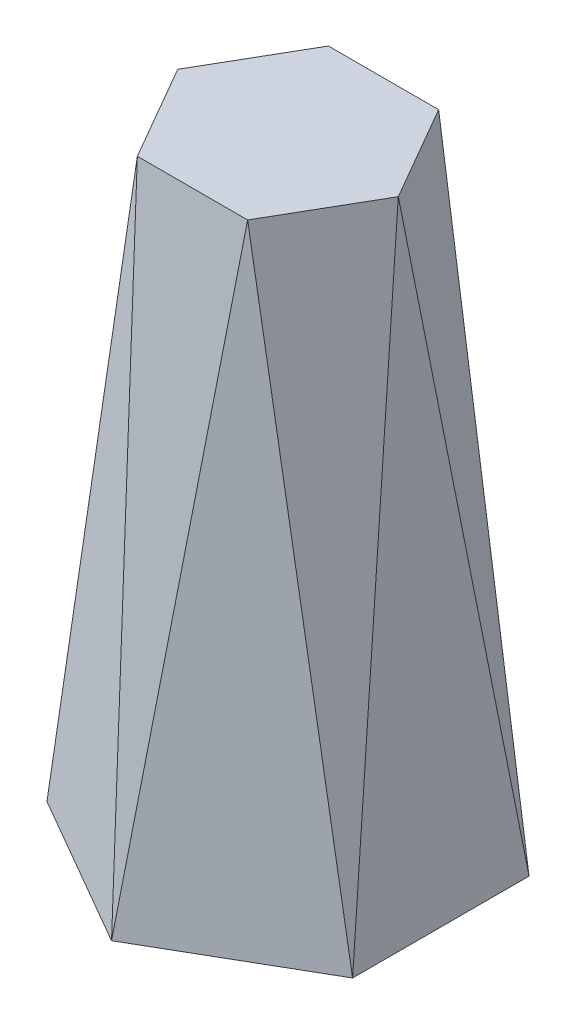
ISO-10303-21;
HEADER;
FILE_DESCRIPTION(('STEP AP214'),'2;1');
FILE_NAME('part.step','',(''),(''),'','','');
FILE_SCHEMA(('AUTOMOTIVE_DESIGN { 1 0 10303 214 1 1 1 1 }'));
ENDSEC;
DATA;
#1=APPLICATION_CONTEXT('core data for automotive mechanical design processes');
#2=APPLICATION_PROTOCOL_DEFINITION('international standard','automotive_design',2000,#1);
#3=PRODUCT_CONTEXT('',#1,'mechanical');
#4=PRODUCT('Part','Part','',(#3));
#5=PRODUCT_RELATED_PRODUCT_CATEGORY('part','',(#4));
#6=PRODUCT_DEFINITION_FORMATION('','',#4);
#7=PRODUCT_DEFINITION_CONTEXT('part definition',#1,'design');
#8=PRODUCT_DEFINITION('design','',#6,#7);
#9=PRODUCT_DEFINITION_SHAPE('','',#8);
#10=(LENGTH_UNIT() NAMED_UNIT(*) SI_UNIT(.MILLI.,.METRE.));
#11=(NAMED_UNIT(*) PLANE_ANGLE_UNIT() SI_UNIT($,.RADIAN.));
#12=(NAMED_UNIT(*) SI_UNIT($,.STERADIAN.) SOLID_ANGLE_UNIT());
#13=UNCERTAINTY_MEASURE_WITH_UNIT(LENGTH_MEASURE(1.E-05),#10,'distance_accuracy_value','');
#14=(GEOMETRIC_REPRESENTATION_CONTEXT(3) GLOBAL_UNCERTAINTY_ASSIGNED_CONTEXT((#13)) GLOBAL_UNIT_ASSIGNED_CONTEXT((#10,
#11,#12)) REPRESENTATION_CONTEXT('',''));
#15=CARTESIAN_POINT('',(0.,0.,0.));
#16=DIRECTION('',(0.,0.,1.));
#17=DIRECTION('',(1.,0.,0.));
#18=AXIS2_PLACEMENT_3D('',#15,#16,#17);
#19=CARTESIAN_POINT('',(0.,80.,0.));
#20=DIRECTION('',(0.,1.,0.));
#21=DIRECTION('',(0.,0.,1.));
#22=AXIS2_PLACEMENT_3D('',#19,#20,#21);
#23=PLANE('',#22);
#24=DIRECTION('',(-1.,0.,0.));
#25=VECTOR('',#24,1.);
#26=CARTESIAN_POINT('',(-1.11291591240031E-13,80.,-12.5));
#27=LINE('',#26,#25);
#28=CARTESIAN_POINT('',(7.21687836487021,80.,-12.5000000000001));
#29=VERTEX_POINT('',#28);
#30=CARTESIAN_POINT('',(-7.21687836487048,80.,-12.4999999999999));
#31=VERTEX_POINT('',#30);
#32=EDGE_CURVE('E117',#29,#31,#27,.T.);
#33=ORIENTED_EDGE('',*,*,#32,.T.);
#34=DIRECTION('',(-0.49999999999999,0.,0.866025403784444));
#35=VECTOR('',#34,1.);
#36=CARTESIAN_POINT('',(-10.8253175473056,80.,-6.24999999999988));
#37=LINE('',#36,#35);
#38=CARTESIAN_POINT('',(-14.4337567297406,80.,0.));
#39=VERTEX_POINT('',#38);
#40=EDGE_CURVE('E103',#31,#39,#37,.T.);
#41=ORIENTED_EDGE('',*,*,#40,.T.);
#42=DIRECTION('',(0.5,0.,0.866025403784439));
#43=VECTOR('',#42,1.);
#44=CARTESIAN_POINT('',(-10.8253175473055,80.,6.25));
#45=LINE('',#44,#43);
#46=CARTESIAN_POINT('',(-7.21687836487034,80.,12.5));
#47=VERTEX_POINT('',#46);
#48=EDGE_CURVE('E115',#39,#47,#45,.T.);
#49=ORIENTED_EDGE('',*,*,#48,.T.);
#50=DIRECTION('',(1.,0.,0.));
#51=VECTOR('',#50,1.);
#52=CARTESIAN_POINT('',(0.,80.,12.5));
#53=LINE('',#52,#51);
#54=CARTESIAN_POINT('',(7.2168783648704,80.,12.5));
#55=VERTEX_POINT('',#54);
#56=EDGE_CURVE('E62',#47,#55,#53,.T.);
#57=ORIENTED_EDGE('',*,*,#56,.T.);
#58=DIRECTION('',(0.499999999999996,0.,-0.866025403784441));
#59=VECTOR('',#58,1.);
#60=CARTESIAN_POINT('',(10.8253175473055,80.,6.24999999999996));
#61=LINE('',#60,#59);
#62=CARTESIAN_POINT('',(14.4337567297406,80.,0.));
#63=VERTEX_POINT('',#62);
#64=EDGE_CURVE('E150',#55,#63,#61,.T.);
#65=ORIENTED_EDGE('',*,*,#64,.T.);
#66=DIRECTION('',(-0.5,0.,-0.866025403784439));
#67=VECTOR('',#66,1.);
#68=CARTESIAN_POINT('',(10.8253175473055,80.,-6.25));
#69=LINE('',#68,#67);
#70=EDGE_CURVE('E159',#63,#29,#69,.T.);
#71=ORIENTED_EDGE('',*,*,#70,.T.);
#72=EDGE_LOOP('',(#33,#41,#49,#57,#65,#71));
#73=FACE_BOUND('',#72,.T.);
#74=ADVANCED_FACE('F47',(#73),#23,.T.);
#75=CARTESIAN_POINT('',(-9.95182219602424,1.38485658313591,-17.2370616714052));
#76=DIRECTION('',(-0.498794100707507,0.0694102326577044,-0.863936724941007));
#77=DIRECTION('',(-0.0347051163288529,-0.997588201414994,-0.0601110247641599));
#78=AXIS2_PLACEMENT_3D('',#75,#76,#77);
#79=PLANE('',#78);
#80=DIRECTION('',(-0.866025403784439,0.,0.5));
#81=VECTOR('',#80,1.);
#82=CARTESIAN_POINT('',(0.,0.,-23.094010767585));
#83=LINE('',#82,#81);
#84=CARTESIAN_POINT('',(-2.37436315882294E-13,0.,-23.0940107675851));
#85=VERTEX_POINT('',#84);
#86=CARTESIAN_POINT('',(-20.,0.,-11.5470053837924));
#87=VERTEX_POINT('',#86);
#88=EDGE_CURVE('E134',#85,#87,#83,.T.);
#89=ORIENTED_EDGE('',*,*,#88,.T.);
#90=DIRECTION('',(0.1577764457849,0.987404800100219,-0.0117623932314135));
#91=VECTOR('',#90,1.);
#92=CARTESIAN_POINT('',(-19.5235611259221,2.98167466556065,-11.5825243825868));
#93=LINE('',#92,#91);
#94=EDGE_CURVE('E105',#87,#31,#93,.T.);
#95=ORIENTED_EDGE('',*,*,#94,.T.);
#96=DIRECTION('',(0.0890747542401528,-0.987404800100219,-0.130757213552837));
#97=VECTOR('',#96,1.);
#98=CARTESIAN_POINT('',(-0.26897979231234,2.98167466556065,-22.6991620986802));
#99=LINE('',#98,#97);
#100=EDGE_CURVE('E12',#31,#85,#99,.T.);
#101=ORIENTED_EDGE('',*,*,#100,.T.);
#102=EDGE_LOOP('',(#89,#95,#101));
#103=FACE_BOUND('',#102,.T.);
#104=ADVANCED_FACE('F172',(#103),#79,.T.);
#105=CARTESIAN_POINT('',(-19.9036443920481,1.38485658313591,0.));
#106=DIRECTION('',(-0.997588201414994,0.0694102326577044,0.));
#107=DIRECTION('',(-0.0694102326577044,-0.997588201414994,0.));
#108=AXIS2_PLACEMENT_3D('',#105,#106,#107);
#109=PLANE('',#108);
#110=DIRECTION('',(0.0687016915447455,0.987404800100219,-0.142519606784248));
#111=VECTOR('',#110,1.);
#112=CARTESIAN_POINT('',(-19.792540918234,2.98167466556065,11.1166377160932));
#113=LINE('',#112,#111);
#114=CARTESIAN_POINT('',(-20.,0.,11.5470053837926));
#115=VERTEX_POINT('',#114);
#116=EDGE_CURVE('E122',#115,#39,#113,.T.);
#117=ORIENTED_EDGE('',*,*,#116,.T.);
#118=DIRECTION('',(-0.0687016915447454,-0.987404800100219,-0.14251960678425));
#119=VECTOR('',#118,1.);
#120=CARTESIAN_POINT('',(-19.792540918234,2.98167466556067,-11.1166377160932));
#121=LINE('',#120,#119);
#122=EDGE_CURVE('E100',#39,#87,#121,.T.);
#123=ORIENTED_EDGE('',*,*,#122,.T.);
#124=DIRECTION('',(0.,0.,1.));
#125=VECTOR('',#124,1.);
#126=CARTESIAN_POINT('',(-20.,0.,-11.5470053837925));
#127=LINE('',#126,#125);
#128=EDGE_CURVE('E128',#87,#115,#127,.T.);
#129=ORIENTED_EDGE('',*,*,#128,.T.);
#130=EDGE_LOOP('',(#117,#123,#129));
#131=FACE_BOUND('',#130,.T.);
#132=ADVANCED_FACE('F126',(#131),#109,.T.);
#133=CARTESIAN_POINT('',(9.95182219602388,1.38485658313591,-17.2370616714054));
#134=DIRECTION('',(0.498794100707489,0.0694102326577044,-0.863936724941017));
#135=DIRECTION('',(0.0347051163288517,-0.997588201414994,-0.0601110247641606));
#136=AXIS2_PLACEMENT_3D('',#133,#134,#135);
#137=PLANE('',#136);
#138=DIRECTION('',(-0.866025403784439,0.,-0.5));
#139=VECTOR('',#138,1.);
#140=CARTESIAN_POINT('',(20.,0.,-11.5470053837925));
#141=LINE('',#140,#139);
#142=CARTESIAN_POINT('',(20.,0.,-11.5470053837926));
#143=VERTEX_POINT('',#142);
#144=EDGE_CURVE('E136',#143,#85,#141,.T.);
#145=ORIENTED_EDGE('',*,*,#144,.T.);
#146=DIRECTION('',(0.0890747542401559,0.987404800100219,0.130757213552835));
#147=VECTOR('',#146,1.);
#148=CARTESIAN_POINT('',(0.268979792311878,2.98167466556065,-22.6991620986802));
#149=LINE('',#148,#147);
#150=EDGE_CURVE('E118',#85,#29,#149,.T.);
#151=ORIENTED_EDGE('',*,*,#150,.T.);
#152=DIRECTION('',(0.157776445784899,-0.987404800100219,0.0117623932314093));
#153=VECTOR('',#152,1.);
#154=CARTESIAN_POINT('',(19.5235611259218,2.98167466556063,-11.5825243825872));
#155=LINE('',#154,#153);
#156=EDGE_CURVE('E164',#29,#143,#155,.T.);
#157=ORIENTED_EDGE('',*,*,#156,.T.);
#158=EDGE_LOOP('',(#145,#151,#157));
#159=FACE_BOUND('',#158,.T.);
#160=ADVANCED_FACE('F178',(#159),#137,.T.);
#161=CARTESIAN_POINT('',(19.9036443920481,1.38485658313591,0.));
#162=DIRECTION('',(0.997588201414994,0.0694102326577044,0.));
#163=DIRECTION('',(0.0694102326577044,-0.997588201414994,0.));
#164=AXIS2_PLACEMENT_3D('',#161,#162,#163);
#165=PLANE('',#164);
#166=DIRECTION('',(0.,0.,-1.));
#167=VECTOR('',#166,1.);
#168=CARTESIAN_POINT('',(20.,0.,11.5470053837925));
#169=LINE('',#168,#167);
#170=CARTESIAN_POINT('',(20.,0.,11.5470053837925));
#171=VERTEX_POINT('',#170);
#172=EDGE_CURVE('E139',#171,#143,#169,.T.);
#173=ORIENTED_EDGE('',*,*,#172,.T.);
#174=DIRECTION('',(-0.0687016915447455,0.987404800100219,0.142519606784248));
#175=VECTOR('',#174,1.);
#176=CARTESIAN_POINT('',(19.792540918234,2.98167466556065,-11.1166377160932));
#177=LINE('',#176,#175);
#178=EDGE_CURVE('E161',#143,#63,#177,.T.);
#179=ORIENTED_EDGE('',*,*,#178,.T.);
#180=DIRECTION('',(0.0687016915447455,-0.987404800100219,0.142519606784248));
#181=VECTOR('',#180,1.);
#182=CARTESIAN_POINT('',(19.792540918234,2.98167466556066,11.1166377160932));
#183=LINE('',#182,#181);
#184=EDGE_CURVE('E156',#63,#171,#183,.T.);
#185=ORIENTED_EDGE('',*,*,#184,.T.);
#186=EDGE_LOOP('',(#173,#179,#185));
#187=FACE_BOUND('',#186,.T.);
#188=ADVANCED_FACE('F193',(#187),#165,.T.);
#189=CARTESIAN_POINT('',(9.95182219602412,1.38485658313591,17.2370616714053));
#190=DIRECTION('',(0.498794100707501,0.0694102326577044,0.86393672494101));
#191=DIRECTION('',(0.0347051163288525,-0.997588201414994,0.0601110247641602));
#192=AXIS2_PLACEMENT_3D('',#189,#190,#191);
#193=PLANE('',#192);
#194=DIRECTION('',(0.866025403784439,0.,-0.5));
#195=VECTOR('',#194,1.);
#196=CARTESIAN_POINT('',(0.,0.,23.094010767585));
#197=LINE('',#196,#195);
#198=CARTESIAN_POINT('',(0.,0.,23.0940107675851));
#199=VERTEX_POINT('',#198);
#200=EDGE_CURVE('E124',#199,#171,#197,.T.);
#201=ORIENTED_EDGE('',*,*,#200,.T.);
#202=DIRECTION('',(-0.1577764457849,0.987404800100219,0.0117623932314123));
#203=VECTOR('',#202,1.);
#204=CARTESIAN_POINT('',(19.523561125922,2.98167466556065,11.5825243825869));
#205=LINE('',#204,#203);
#206=EDGE_CURVE('E153',#171,#55,#205,.T.);
#207=ORIENTED_EDGE('',*,*,#206,.T.);
#208=DIRECTION('',(-0.0890747542401537,-0.98740480010022,0.130757213552836));
#209=VECTOR('',#208,1.);
#210=CARTESIAN_POINT('',(0.268979792312182,2.98167466556065,22.6991620986802));
#211=LINE('',#210,#209);
#212=EDGE_CURVE('E145',#55,#199,#211,.T.);
#213=ORIENTED_EDGE('',*,*,#212,.T.);
#214=EDGE_LOOP('',(#201,#207,#213));
#215=FACE_BOUND('',#214,.T.);
#216=ADVANCED_FACE('F186',(#215),#193,.T.);
#217=CARTESIAN_POINT('',(-9.951822196024,1.38485658313591,17.2370616714053));
#218=DIRECTION('',(-0.498794100707495,0.0694102326577044,0.863936724941014));
#219=DIRECTION('',(-0.0347051163288521,-0.997588201414994,0.0601110247641604));
#220=AXIS2_PLACEMENT_3D('',#217,#218,#219);
#221=PLANE('',#220);
#222=DIRECTION('',(0.866025403784438,0.,0.5));
#223=VECTOR('',#222,1.);
#224=CARTESIAN_POINT('',(-20.,0.,11.5470053837925));
#225=LINE('',#224,#223);
#226=EDGE_CURVE('E129',#115,#199,#225,.T.);
#227=ORIENTED_EDGE('',*,*,#226,.T.);
#228=DIRECTION('',(-0.089074754240155,0.987404800100219,-0.130757213552836));
#229=VECTOR('',#228,1.);
#230=CARTESIAN_POINT('',(-0.268979792312029,2.98167466556065,22.6991620986802));
#231=LINE('',#230,#229);
#232=EDGE_CURVE('E148',#199,#47,#231,.T.);
#233=ORIENTED_EDGE('',*,*,#232,.T.);
#234=DIRECTION('',(0.1577764457849,0.98740480010022,0.0117623932314111));
#235=VECTOR('',#234,1.);
#236=CARTESIAN_POINT('',(-19.5235611259219,2.98167466556065,11.5825243825871));
#237=LINE('',#236,#235);
#238=EDGE_CURVE('E55',#115,#47,#237,.T.);
#239=ORIENTED_EDGE('',*,*,#238,.F.);
#240=EDGE_LOOP('',(#227,#233,#239));
#241=FACE_BOUND('',#240,.T.);
#242=ADVANCED_FACE('F190',(#241),#221,.T.);
#243=CARTESIAN_POINT('',(-19.6553161932682,3.00552140967566,11.3480020951906));
#244=DIRECTION('',(-0.858530347307278,0.131279055209097,0.49567272712532));
#245=DIRECTION('',(0.5,0.,0.866025403784439));
#246=AXIS2_PLACEMENT_3D('',#243,#244,#245);
#247=PLANE('',#246);
#248=ORIENTED_EDGE('',*,*,#116,.F.);
#249=ORIENTED_EDGE('',*,*,#238,.T.);
#250=ORIENTED_EDGE('',*,*,#48,.F.);
#251=EDGE_LOOP('',(#248,#249,#250));
#252=FACE_BOUND('',#251,.T.);
#253=ADVANCED_FACE('F121',(#252),#247,.T.);
#254=CARTESIAN_POINT('',(0.,0.,0.));
#255=DIRECTION('',(0.,1.,0.));
#256=DIRECTION('',(0.,0.,1.));
#257=AXIS2_PLACEMENT_3D('',#254,#255,#256);
#258=PLANE('',#257);
#259=ORIENTED_EDGE('',*,*,#200,.F.);
#260=ORIENTED_EDGE('',*,*,#226,.F.);
#261=ORIENTED_EDGE('',*,*,#128,.F.);
#262=ORIENTED_EDGE('',*,*,#88,.F.);
#263=ORIENTED_EDGE('',*,*,#144,.F.);
#264=ORIENTED_EDGE('',*,*,#172,.F.);
#265=EDGE_LOOP('',(#259,#260,#261,#262,#263,#264));
#266=FACE_BOUND('',#265,.T.);
#267=ADVANCED_FACE('F49',(#266),#258,.F.);
#268=CARTESIAN_POINT('',(0.,3.00552140967566,22.6960041903812));
#269=DIRECTION('',(0.,0.131279055209097,0.99134545425064));
#270=DIRECTION('',(1.,0.,0.));
#271=AXIS2_PLACEMENT_3D('',#268,#269,#270);
#272=PLANE('',#271);
#273=ORIENTED_EDGE('',*,*,#56,.F.);
#274=ORIENTED_EDGE('',*,*,#232,.F.);
#275=ORIENTED_EDGE('',*,*,#212,.F.);
#276=EDGE_LOOP('',(#273,#274,#275));
#277=FACE_BOUND('',#276,.T.);
#278=ADVANCED_FACE('F189',(#277),#272,.T.);
#279=CARTESIAN_POINT('',(19.6553161932682,3.00552140967566,11.3480020951905));
#280=DIRECTION('',(0.85853034730728,0.131279055209097,0.495672727125316));
#281=DIRECTION('',(0.499999999999996,0.,-0.866025403784441));
#282=AXIS2_PLACEMENT_3D('',#279,#280,#281);
#283=PLANE('',#282);
#284=ORIENTED_EDGE('',*,*,#64,.F.);
#285=ORIENTED_EDGE('',*,*,#206,.F.);
#286=ORIENTED_EDGE('',*,*,#184,.F.);
#287=EDGE_LOOP('',(#284,#285,#286));
#288=FACE_BOUND('',#287,.T.);
#289=ADVANCED_FACE('F184',(#288),#283,.T.);
#290=CARTESIAN_POINT('',(19.6553161932682,3.00552140967566,-11.3480020951906));
#291=DIRECTION('',(0.858530347307278,0.131279055209097,-0.49567272712532));
#292=DIRECTION('',(-0.5,0.,-0.866025403784439));
#293=AXIS2_PLACEMENT_3D('',#290,#291,#292);
#294=PLANE('',#293);
#295=ORIENTED_EDGE('',*,*,#70,.F.);
#296=ORIENTED_EDGE('',*,*,#178,.F.);
#297=ORIENTED_EDGE('',*,*,#156,.F.);
#298=EDGE_LOOP('',(#295,#296,#297));
#299=FACE_BOUND('',#298,.T.);
#300=ADVANCED_FACE('F181',(#299),#294,.T.);
#301=CARTESIAN_POINT('',(-2.02962646689286E-13,3.00552140967566,-22.6960041903812));
#302=DIRECTION('',(0.,0.131279055209097,-0.99134545425064));
#303=DIRECTION('',(-1.,0.,0.));
#304=AXIS2_PLACEMENT_3D('',#301,#302,#303);
#305=PLANE('',#304);
#306=ORIENTED_EDGE('',*,*,#32,.F.);
#307=ORIENTED_EDGE('',*,*,#150,.F.);
#308=ORIENTED_EDGE('',*,*,#100,.F.);
#309=EDGE_LOOP('',(#306,#307,#308));
#310=FACE_BOUND('',#309,.T.);
#311=ADVANCED_FACE('F175',(#310),#305,.T.);
#312=CARTESIAN_POINT('',(-19.6553161932683,3.00552140967566,-11.3480020951904));
#313=DIRECTION('',(-0.858530347307284,0.131279055209097,-0.49567272712531));
#314=DIRECTION('',(-0.49999999999999,0.,0.866025403784444));
#315=AXIS2_PLACEMENT_3D('',#312,#313,#314);
#316=PLANE('',#315);
#317=ORIENTED_EDGE('',*,*,#40,.F.);
#318=ORIENTED_EDGE('',*,*,#94,.F.);
#319=ORIENTED_EDGE('',*,*,#122,.F.);
#320=EDGE_LOOP('',(#317,#318,#319));
#321=FACE_BOUND('',#320,.T.);
#322=ADVANCED_FACE('F102',(#321),#316,.T.);
#323=CLOSED_SHELL('',(#74,#104,#132,#160,#188,#216,#242,#253,#267,#278,#289,#300,#311,#322));
#324=MANIFOLD_SOLID_BREP('B2',#323);
#325=ADVANCED_BREP_SHAPE_REPRESENTATION('',(#18,#324),#14);
#326=SHAPE_DEFINITION_REPRESENTATION(#9,#325);
ENDSEC;
END-ISO-10303-21;
